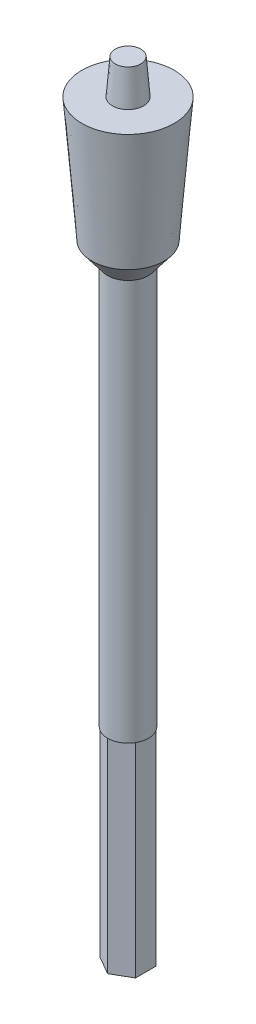
ISO-10303-21;
HEADER;
FILE_DESCRIPTION(('STEP AP214'),'2;1');
FILE_NAME('part.step','',(''),(''),'','','');
FILE_SCHEMA(('AUTOMOTIVE_DESIGN { 1 0 10303 214 1 1 1 1 }'));
ENDSEC;
DATA;
#1=APPLICATION_CONTEXT('core data for automotive mechanical design processes');
#2=APPLICATION_PROTOCOL_DEFINITION('international standard','automotive_design',2000,#1);
#3=PRODUCT_CONTEXT('',#1,'mechanical');
#4=PRODUCT('Part','Part','',(#3));
#5=PRODUCT_RELATED_PRODUCT_CATEGORY('part','',(#4));
#6=PRODUCT_DEFINITION_FORMATION('','',#4);
#7=PRODUCT_DEFINITION_CONTEXT('part definition',#1,'design');
#8=PRODUCT_DEFINITION('design','',#6,#7);
#9=PRODUCT_DEFINITION_SHAPE('','',#8);
#10=(LENGTH_UNIT() NAMED_UNIT(*) SI_UNIT(.MILLI.,.METRE.));
#11=(NAMED_UNIT(*) PLANE_ANGLE_UNIT() SI_UNIT($,.RADIAN.));
#12=(NAMED_UNIT(*) SI_UNIT($,.STERADIAN.) SOLID_ANGLE_UNIT());
#13=UNCERTAINTY_MEASURE_WITH_UNIT(LENGTH_MEASURE(1.E-05),#10,'distance_accuracy_value','');
#14=(GEOMETRIC_REPRESENTATION_CONTEXT(3) GLOBAL_UNCERTAINTY_ASSIGNED_CONTEXT((#13)) GLOBAL_UNIT_ASSIGNED_CONTEXT((#10,
#11,#12)) REPRESENTATION_CONTEXT('',''));
#15=CARTESIAN_POINT('',(0.,0.,0.));
#16=DIRECTION('',(0.,0.,1.));
#17=DIRECTION('',(1.,0.,0.));
#18=AXIS2_PLACEMENT_3D('',#15,#16,#17);
#19=CARTESIAN_POINT('',(0.,128.637668016907,0.));
#20=DIRECTION('',(0.,-1.,0.));
#21=DIRECTION('',(0.,0.,-1.));
#22=AXIS2_PLACEMENT_3D('',#19,#20,#21);
#23=CONICAL_SURFACE('',#22,2.68609177741391,0.0802658212378928);
#24=CARTESIAN_POINT('',(0.,128.637668016907,0.));
#25=DIRECTION('',(0.,-1.,0.));
#26=DIRECTION('',(0.,0.,-1.));
#27=AXIS2_PLACEMENT_3D('',#24,#25,#26);
#28=CIRCLE('',#27,2.68609177741391);
#29=CARTESIAN_POINT('',(0.,128.637668016907,-2.68609177741391));
#30=VERTEX_POINT('',#29);
#31=EDGE_CURVE('E111',#30,#30,#28,.T.);
#32=ORIENTED_EDGE('',*,*,#31,.F.);
#33=EDGE_LOOP('',(#32));
#34=FACE_BOUND('',#33,.T.);
#35=CARTESIAN_POINT('',(0.,134.637668016907,0.));
#36=DIRECTION('',(0.,1.,0.));
#37=DIRECTION('',(0.,0.,1.));
#38=AXIS2_PLACEMENT_3D('',#35,#36,#37);
#39=CIRCLE('',#38,2.20345993624516);
#40=CARTESIAN_POINT('',(0.,134.637668016907,2.20345993624516));
#41=VERTEX_POINT('',#40);
#42=EDGE_CURVE('E48',#41,#41,#39,.F.);
#43=ORIENTED_EDGE('',*,*,#42,.T.);
#44=EDGE_LOOP('',(#43));
#45=FACE_BOUND('',#44,.T.);
#46=ADVANCED_FACE('F44',(#34,#45),#23,.T.);
#47=CARTESIAN_POINT('',(0.,0.,0.));
#48=DIRECTION('',(0.,-1.,0.));
#49=DIRECTION('',(0.,0.,-1.));
#50=AXIS2_PLACEMENT_3D('',#47,#48,#49);
#51=CYLINDRICAL_SURFACE('',#50,3.5);
#52=CARTESIAN_POINT('',(0.,103.794837091438,0.));
#53=DIRECTION('',(0.,-1.,0.));
#54=DIRECTION('',(0.,0.,-1.));
#55=AXIS2_PLACEMENT_3D('',#52,#53,#54);
#56=CIRCLE('',#55,3.5);
#57=CARTESIAN_POINT('',(0.,103.794837091438,-3.5));
#58=VERTEX_POINT('',#57);
#59=EDGE_CURVE('E162',#58,#58,#56,.T.);
#60=ORIENTED_EDGE('',*,*,#59,.T.);
#61=EDGE_LOOP('',(#60));
#62=FACE_BOUND('',#61,.T.);
#63=CARTESIAN_POINT('',(0.,35.,0.));
#64=DIRECTION('',(0.,-1.,0.));
#65=DIRECTION('',(0.,0.,-1.));
#66=AXIS2_PLACEMENT_3D('',#63,#64,#65);
#67=CIRCLE('',#66,3.5);
#68=CARTESIAN_POINT('',(-3.03108891324553,35.,-1.75000000000001));
#69=VERTEX_POINT('',#68);
#70=CARTESIAN_POINT('',(-3.03108891324554,35.,1.74999999999999));
#71=VERTEX_POINT('',#70);
#72=EDGE_CURVE('E54',#69,#71,#67,.F.);
#73=ORIENTED_EDGE('',*,*,#72,.T.);
#74=CARTESIAN_POINT('',(0.,35.,3.5));
#75=VERTEX_POINT('',#74);
#76=EDGE_CURVE('E11',#71,#75,#67,.F.);
#77=ORIENTED_EDGE('',*,*,#76,.T.);
#78=CARTESIAN_POINT('',(3.03108891324551,35.,1.75000000000003));
#79=VERTEX_POINT('',#78);
#80=EDGE_CURVE('E55',#75,#79,#67,.F.);
#81=ORIENTED_EDGE('',*,*,#80,.T.);
#82=CARTESIAN_POINT('',(3.03108891324555,35.,-1.74999999999997));
#83=VERTEX_POINT('',#82);
#84=EDGE_CURVE('E110',#79,#83,#67,.F.);
#85=ORIENTED_EDGE('',*,*,#84,.T.);
#86=CARTESIAN_POINT('',(0.,35.,-3.5));
#87=VERTEX_POINT('',#86);
#88=EDGE_CURVE('E149',#83,#87,#67,.F.);
#89=ORIENTED_EDGE('',*,*,#88,.T.);
#90=EDGE_CURVE('E145',#87,#69,#67,.F.);
#91=ORIENTED_EDGE('',*,*,#90,.T.);
#92=EDGE_LOOP('',(#73,#77,#81,#85,#89,#91));
#93=FACE_BOUND('',#92,.T.);
#94=ADVANCED_FACE('F141',(#62,#93),#51,.T.);
#95=CARTESIAN_POINT('',(2.68609177741391,128.637668016907,0.));
#96=DIRECTION('',(0.,1.,0.));
#97=DIRECTION('',(0.,0.,1.));
#98=AXIS2_PLACEMENT_3D('',#95,#96,#97);
#99=PLANE('',#98);
#100=ORIENTED_EDGE('',*,*,#31,.T.);
#101=EDGE_LOOP('',(#100));
#102=FACE_BOUND('',#101,.T.);
#103=CARTESIAN_POINT('',(0.,128.637668016907,0.));
#104=DIRECTION('',(0.,-1.,0.));
#105=DIRECTION('',(0.,0.,-1.));
#106=AXIS2_PLACEMENT_3D('',#103,#104,#105);
#107=CIRCLE('',#106,7.91865793456756);
#108=CARTESIAN_POINT('',(0.,128.637668016907,-7.91865793456756));
#109=VERTEX_POINT('',#108);
#110=EDGE_CURVE('E154',#109,#109,#107,.T.);
#111=ORIENTED_EDGE('',*,*,#110,.F.);
#112=EDGE_LOOP('',(#111));
#113=FACE_BOUND('',#112,.T.);
#114=ADVANCED_FACE('F229',(#102,#113),#99,.T.);
#115=CARTESIAN_POINT('',(0.,107.320079818134,0.));
#116=DIRECTION('',(0.,1.,0.));
#117=DIRECTION('',(0.,0.,1.));
#118=AXIS2_PLACEMENT_3D('',#115,#116,#117);
#119=CONICAL_SURFACE('',#118,6.21366054536034,0.0798108905820087);
#120=ORIENTED_EDGE('',*,*,#110,.T.);
#121=EDGE_LOOP('',(#120));
#122=FACE_BOUND('',#121,.T.);
#123=CARTESIAN_POINT('',(0.,107.320079818134,0.));
#124=DIRECTION('',(0.,-1.,0.));
#125=DIRECTION('',(0.,0.,-1.));
#126=AXIS2_PLACEMENT_3D('',#123,#124,#125);
#127=CIRCLE('',#126,6.21366054536034);
#128=CARTESIAN_POINT('',(0.,107.320079818134,-6.21366054536034));
#129=VERTEX_POINT('',#128);
#130=EDGE_CURVE('E158',#129,#129,#127,.T.);
#131=ORIENTED_EDGE('',*,*,#130,.F.);
#132=EDGE_LOOP('',(#131));
#133=FACE_BOUND('',#132,.T.);
#134=ADVANCED_FACE('F236',(#122,#133),#119,.T.);
#135=CARTESIAN_POINT('',(0.,103.794837091438,0.));
#136=DIRECTION('',(0.,1.,0.));
#137=DIRECTION('',(0.,0.,1.));
#138=AXIS2_PLACEMENT_3D('',#135,#136,#137);
#139=CONICAL_SURFACE('',#138,3.5,0.656040447788487);
#140=ORIENTED_EDGE('',*,*,#130,.T.);
#141=EDGE_LOOP('',(#140));
#142=FACE_BOUND('',#141,.T.);
#143=ORIENTED_EDGE('',*,*,#59,.F.);
#144=EDGE_LOOP('',(#143));
#145=FACE_BOUND('',#144,.T.);
#146=ADVANCED_FACE('F217',(#142,#145),#139,.T.);
#147=CARTESIAN_POINT('',(0.,35.,0.));
#148=DIRECTION('',(0.,-1.,0.));
#149=DIRECTION('',(0.,0.,-1.));
#150=AXIS2_PLACEMENT_3D('',#147,#148,#149);
#151=PLANE('',#150);
#152=DIRECTION('',(0.866025403784442,0.,-0.499999999999995));
#153=VECTOR('',#152,1.);
#154=CARTESIAN_POINT('',(-3.03108891324553,35.,-1.75000000000001));
#155=LINE('',#154,#153);
#156=EDGE_CURVE('E62',#69,#87,#155,.T.);
#157=ORIENTED_EDGE('',*,*,#156,.F.);
#158=ORIENTED_EDGE('',*,*,#90,.F.);
#159=EDGE_LOOP('',(#157,#158));
#160=FACE_BOUND('',#159,.T.);
#161=ADVANCED_FACE('F211',(#160),#151,.T.);
#162=DIRECTION('',(0.,0.,-1.));
#163=VECTOR('',#162,1.);
#164=CARTESIAN_POINT('',(-3.03108891324554,35.,1.74999999999999));
#165=LINE('',#164,#163);
#166=EDGE_CURVE('E133',#71,#69,#165,.T.);
#167=ORIENTED_EDGE('',*,*,#166,.F.);
#168=ORIENTED_EDGE('',*,*,#72,.F.);
#169=EDGE_LOOP('',(#167,#168));
#170=FACE_BOUND('',#169,.T.);
#171=ADVANCED_FACE('F209',(#170),#151,.T.);
#172=DIRECTION('',(-0.866025403784438,0.,-0.500000000000001));
#173=VECTOR('',#172,1.);
#174=CARTESIAN_POINT('',(0.,35.,3.5));
#175=LINE('',#174,#173);
#176=EDGE_CURVE('E118',#75,#71,#175,.T.);
#177=ORIENTED_EDGE('',*,*,#176,.F.);
#178=ORIENTED_EDGE('',*,*,#76,.F.);
#179=EDGE_LOOP('',(#177,#178));
#180=FACE_BOUND('',#179,.T.);
#181=ADVANCED_FACE('F130',(#180),#151,.T.);
#182=DIRECTION('',(-0.866025403784441,0.,0.499999999999995));
#183=VECTOR('',#182,1.);
#184=CARTESIAN_POINT('',(3.03108891324551,35.,1.75000000000003));
#185=LINE('',#184,#183);
#186=EDGE_CURVE('E105',#79,#75,#185,.T.);
#187=ORIENTED_EDGE('',*,*,#186,.F.);
#188=ORIENTED_EDGE('',*,*,#80,.F.);
#189=EDGE_LOOP('',(#187,#188));
#190=FACE_BOUND('',#189,.T.);
#191=ADVANCED_FACE('F103',(#190),#151,.T.);
#192=DIRECTION('',(0.,0.,1.));
#193=VECTOR('',#192,1.);
#194=CARTESIAN_POINT('',(3.03108891324555,35.,-1.74999999999997));
#195=LINE('',#194,#193);
#196=EDGE_CURVE('E127',#83,#79,#195,.T.);
#197=ORIENTED_EDGE('',*,*,#196,.F.);
#198=ORIENTED_EDGE('',*,*,#84,.F.);
#199=EDGE_LOOP('',(#197,#198));
#200=FACE_BOUND('',#199,.T.);
#201=ADVANCED_FACE('F285',(#200),#151,.T.);
#202=DIRECTION('',(0.866025403784435,0.,0.500000000000007));
#203=VECTOR('',#202,1.);
#204=CARTESIAN_POINT('',(0.,35.,-3.5));
#205=LINE('',#204,#203);
#206=EDGE_CURVE('E199',#87,#83,#205,.T.);
#207=ORIENTED_EDGE('',*,*,#206,.F.);
#208=ORIENTED_EDGE('',*,*,#88,.F.);
#209=EDGE_LOOP('',(#207,#208));
#210=FACE_BOUND('',#209,.T.);
#211=ADVANCED_FACE('F219',(#210),#151,.T.);
#212=CARTESIAN_POINT('',(3.03108891324551,35.,1.75000000000003));
#213=DIRECTION('',(0.499999999999995,0.,0.866025403784441));
#214=DIRECTION('',(0.866025403784441,0.,-0.499999999999995));
#215=AXIS2_PLACEMENT_3D('',#212,#213,#214);
#216=PLANE('',#215);
#217=DIRECTION('',(-0.866025403784441,0.,0.499999999999995));
#218=VECTOR('',#217,1.);
#219=CARTESIAN_POINT('',(3.03108891324551,0.,1.75000000000003));
#220=LINE('',#219,#218);
#221=CARTESIAN_POINT('',(3.03108891324551,0.,1.75000000000003));
#222=VERTEX_POINT('',#221);
#223=CARTESIAN_POINT('',(0.,0.,3.5));
#224=VERTEX_POINT('',#223);
#225=EDGE_CURVE('E194',#222,#224,#220,.T.);
#226=ORIENTED_EDGE('',*,*,#225,.F.);
#227=DIRECTION('',(0.,-1.,0.));
#228=VECTOR('',#227,1.);
#229=CARTESIAN_POINT('',(3.03108891324551,35.,1.75000000000003));
#230=LINE('',#229,#228);
#231=EDGE_CURVE('E137',#79,#222,#230,.T.);
#232=ORIENTED_EDGE('',*,*,#231,.F.);
#233=ORIENTED_EDGE('',*,*,#186,.T.);
#234=DIRECTION('',(0.,-1.,0.));
#235=VECTOR('',#234,1.);
#236=CARTESIAN_POINT('',(0.,35.,3.5));
#237=LINE('',#236,#235);
#238=EDGE_CURVE('E115',#75,#224,#237,.T.);
#239=ORIENTED_EDGE('',*,*,#238,.T.);
#240=EDGE_LOOP('',(#226,#232,#233,#239));
#241=FACE_BOUND('',#240,.T.);
#242=ADVANCED_FACE('F136',(#241),#216,.T.);
#243=CARTESIAN_POINT('',(3.03108891324555,35.,-1.74999999999997));
#244=DIRECTION('',(1.,0.,0.));
#245=DIRECTION('',(0.,0.,-1.));
#246=AXIS2_PLACEMENT_3D('',#243,#244,#245);
#247=PLANE('',#246);
#248=DIRECTION('',(0.,0.,1.));
#249=VECTOR('',#248,1.);
#250=CARTESIAN_POINT('',(3.03108891324555,0.,-1.74999999999997));
#251=LINE('',#250,#249);
#252=CARTESIAN_POINT('',(3.03108891324555,0.,-1.74999999999997));
#253=VERTEX_POINT('',#252);
#254=EDGE_CURVE('E139',#253,#222,#251,.T.);
#255=ORIENTED_EDGE('',*,*,#254,.F.);
#256=DIRECTION('',(0.,-1.,0.));
#257=VECTOR('',#256,1.);
#258=CARTESIAN_POINT('',(3.03108891324555,35.,-1.74999999999997));
#259=LINE('',#258,#257);
#260=EDGE_CURVE('E174',#83,#253,#259,.T.);
#261=ORIENTED_EDGE('',*,*,#260,.F.);
#262=ORIENTED_EDGE('',*,*,#196,.T.);
#263=ORIENTED_EDGE('',*,*,#231,.T.);
#264=EDGE_LOOP('',(#255,#261,#262,#263));
#265=FACE_BOUND('',#264,.T.);
#266=ADVANCED_FACE('F309',(#265),#247,.T.);
#267=CARTESIAN_POINT('',(0.,35.,-3.5));
#268=DIRECTION('',(0.500000000000007,0.,-0.866025403784435));
#269=DIRECTION('',(-0.866025403784435,0.,-0.500000000000007));
#270=AXIS2_PLACEMENT_3D('',#267,#268,#269);
#271=PLANE('',#270);
#272=DIRECTION('',(0.866025403784435,0.,0.500000000000007));
#273=VECTOR('',#272,1.);
#274=CARTESIAN_POINT('',(0.,0.,-3.5));
#275=LINE('',#274,#273);
#276=CARTESIAN_POINT('',(0.,0.,-3.5));
#277=VERTEX_POINT('',#276);
#278=EDGE_CURVE('E182',#277,#253,#275,.T.);
#279=ORIENTED_EDGE('',*,*,#278,.F.);
#280=DIRECTION('',(0.,-1.,0.));
#281=VECTOR('',#280,1.);
#282=CARTESIAN_POINT('',(0.,35.,-3.5));
#283=LINE('',#282,#281);
#284=EDGE_CURVE('E171',#87,#277,#283,.T.);
#285=ORIENTED_EDGE('',*,*,#284,.F.);
#286=ORIENTED_EDGE('',*,*,#206,.T.);
#287=ORIENTED_EDGE('',*,*,#260,.T.);
#288=EDGE_LOOP('',(#279,#285,#286,#287));
#289=FACE_BOUND('',#288,.T.);
#290=ADVANCED_FACE('F317',(#289),#271,.T.);
#291=CARTESIAN_POINT('',(-3.03108891324553,35.,-1.75000000000001));
#292=DIRECTION('',(-0.499999999999995,0.,-0.866025403784441));
#293=DIRECTION('',(-0.866025403784442,0.,0.499999999999995));
#294=AXIS2_PLACEMENT_3D('',#291,#292,#293);
#295=PLANE('',#294);
#296=DIRECTION('',(0.866025403784442,0.,-0.499999999999995));
#297=VECTOR('',#296,1.);
#298=CARTESIAN_POINT('',(-3.03108891324553,0.,-1.75000000000001));
#299=LINE('',#298,#297);
#300=CARTESIAN_POINT('',(-3.03108891324553,0.,-1.75000000000001));
#301=VERTEX_POINT('',#300);
#302=EDGE_CURVE('E186',#301,#277,#299,.T.);
#303=ORIENTED_EDGE('',*,*,#302,.F.);
#304=DIRECTION('',(0.,-1.,0.));
#305=VECTOR('',#304,1.);
#306=CARTESIAN_POINT('',(-3.03108891324553,35.,-1.75000000000001));
#307=LINE('',#306,#305);
#308=EDGE_CURVE('E168',#69,#301,#307,.T.);
#309=ORIENTED_EDGE('',*,*,#308,.F.);
#310=ORIENTED_EDGE('',*,*,#156,.T.);
#311=ORIENTED_EDGE('',*,*,#284,.T.);
#312=EDGE_LOOP('',(#303,#309,#310,#311));
#313=FACE_BOUND('',#312,.T.);
#314=ADVANCED_FACE('F327',(#313),#295,.T.);
#315=CARTESIAN_POINT('',(-3.03108891324554,35.,1.74999999999999));
#316=DIRECTION('',(-1.,0.,0.));
#317=DIRECTION('',(0.,0.,1.));
#318=AXIS2_PLACEMENT_3D('',#315,#316,#317);
#319=PLANE('',#318);
#320=DIRECTION('',(0.,0.,-1.));
#321=VECTOR('',#320,1.);
#322=CARTESIAN_POINT('',(-3.03108891324554,0.,1.74999999999999));
#323=LINE('',#322,#321);
#324=CARTESIAN_POINT('',(-3.03108891324554,0.,1.75));
#325=VERTEX_POINT('',#324);
#326=EDGE_CURVE('E70',#325,#301,#323,.T.);
#327=ORIENTED_EDGE('',*,*,#326,.F.);
#328=DIRECTION('',(0.,-1.,0.));
#329=VECTOR('',#328,1.);
#330=CARTESIAN_POINT('',(-3.03108891324554,35.,1.74999999999999));
#331=LINE('',#330,#329);
#332=EDGE_CURVE('E126',#71,#325,#331,.T.);
#333=ORIENTED_EDGE('',*,*,#332,.F.);
#334=ORIENTED_EDGE('',*,*,#166,.T.);
#335=ORIENTED_EDGE('',*,*,#308,.T.);
#336=EDGE_LOOP('',(#327,#333,#334,#335));
#337=FACE_BOUND('',#336,.T.);
#338=ADVANCED_FACE('F207',(#337),#319,.T.);
#339=CARTESIAN_POINT('',(0.,35.,3.5));
#340=DIRECTION('',(-0.500000000000001,0.,0.866025403784438));
#341=DIRECTION('',(0.866025403784438,0.,0.500000000000001));
#342=AXIS2_PLACEMENT_3D('',#339,#340,#341);
#343=PLANE('',#342);
#344=DIRECTION('',(-0.866025403784438,0.,-0.500000000000001));
#345=VECTOR('',#344,1.);
#346=CARTESIAN_POINT('',(0.,0.,3.5));
#347=LINE('',#346,#345);
#348=EDGE_CURVE('E121',#224,#325,#347,.T.);
#349=ORIENTED_EDGE('',*,*,#348,.F.);
#350=ORIENTED_EDGE('',*,*,#238,.F.);
#351=ORIENTED_EDGE('',*,*,#176,.T.);
#352=ORIENTED_EDGE('',*,*,#332,.T.);
#353=EDGE_LOOP('',(#349,#350,#351,#352));
#354=FACE_BOUND('',#353,.T.);
#355=ADVANCED_FACE('F117',(#354),#343,.T.);
#356=CARTESIAN_POINT('',(3.5,0.,0.));
#357=DIRECTION('',(0.,-1.,0.));
#358=DIRECTION('',(0.,0.,-1.));
#359=AXIS2_PLACEMENT_3D('',#356,#357,#358);
#360=PLANE('',#359);
#361=ORIENTED_EDGE('',*,*,#254,.T.);
#362=ORIENTED_EDGE('',*,*,#225,.T.);
#363=ORIENTED_EDGE('',*,*,#348,.T.);
#364=ORIENTED_EDGE('',*,*,#326,.T.);
#365=ORIENTED_EDGE('',*,*,#302,.T.);
#366=ORIENTED_EDGE('',*,*,#278,.T.);
#367=EDGE_LOOP('',(#361,#362,#363,#364,#365,#366));
#368=FACE_BOUND('',#367,.T.);
#369=ADVANCED_FACE('F46',(#368),#360,.T.);
#370=CARTESIAN_POINT('',(0.,134.637668016907,0.));
#371=DIRECTION('',(0.,1.,0.));
#372=DIRECTION('',(0.,0.,1.));
#373=AXIS2_PLACEMENT_3D('',#370,#371,#372);
#374=PLANE('',#373);
#375=ORIENTED_EDGE('',*,*,#42,.F.);
#376=EDGE_LOOP('',(#375));
#377=FACE_BOUND('',#376,.T.);
#378=ADVANCED_FACE('F361',(#377),#374,.T.);
#379=CLOSED_SHELL('',(#46,#94,#114,#134,#146,#161,#171,#181,#191,#201,#211,#242,#266,#290,#314,
#338,#355,#369,#378));
#380=MANIFOLD_SOLID_BREP('B2',#379);
#381=ADVANCED_BREP_SHAPE_REPRESENTATION('',(#18,#380),#14);
#382=SHAPE_DEFINITION_REPRESENTATION(#9,#381);
ENDSEC;
END-ISO-10303-21;
